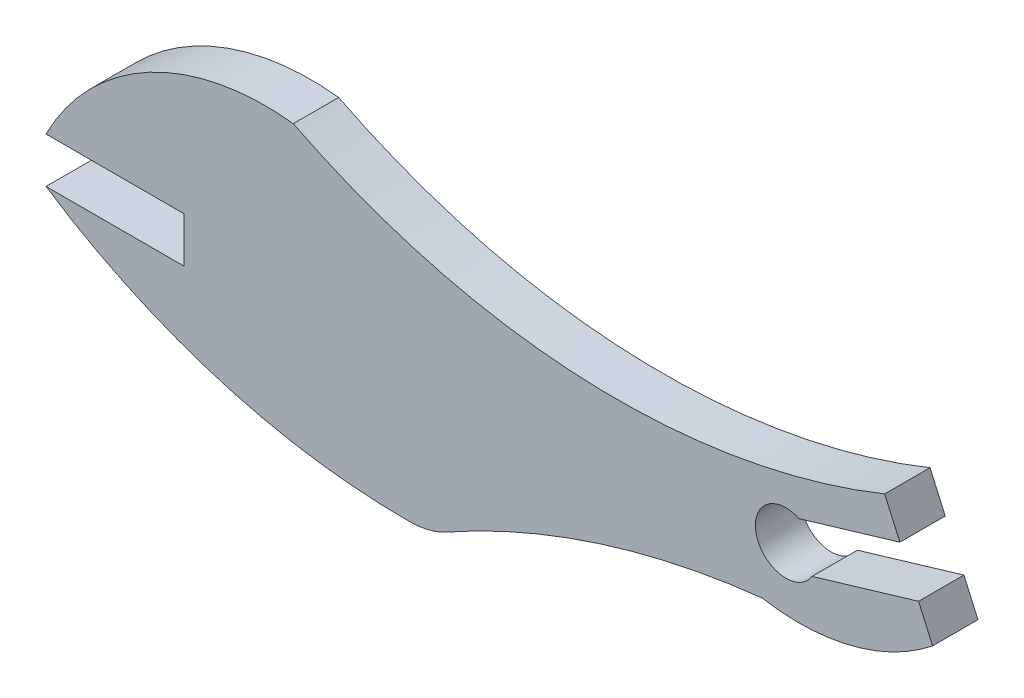
ISO-10303-21;
HEADER;
FILE_DESCRIPTION(('STEP AP214'),'2;1');
FILE_NAME('part.step','',(''),(''),'','','');
FILE_SCHEMA(('AUTOMOTIVE_DESIGN { 1 0 10303 214 1 1 1 1 }'));
ENDSEC;
DATA;
#1=APPLICATION_CONTEXT('core data for automotive mechanical design processes');
#2=APPLICATION_PROTOCOL_DEFINITION('international standard','automotive_design',2000,#1);
#3=PRODUCT_CONTEXT('',#1,'mechanical');
#4=PRODUCT('Part','Part','',(#3));
#5=PRODUCT_RELATED_PRODUCT_CATEGORY('part','',(#4));
#6=PRODUCT_DEFINITION_FORMATION('','',#4);
#7=PRODUCT_DEFINITION_CONTEXT('part definition',#1,'design');
#8=PRODUCT_DEFINITION('design','',#6,#7);
#9=PRODUCT_DEFINITION_SHAPE('','',#8);
#10=(LENGTH_UNIT() NAMED_UNIT(*) SI_UNIT(.MILLI.,.METRE.));
#11=(NAMED_UNIT(*) PLANE_ANGLE_UNIT() SI_UNIT($,.RADIAN.));
#12=(NAMED_UNIT(*) SI_UNIT($,.STERADIAN.) SOLID_ANGLE_UNIT());
#13=UNCERTAINTY_MEASURE_WITH_UNIT(LENGTH_MEASURE(1.E-05),#10,'distance_accuracy_value','');
#14=(GEOMETRIC_REPRESENTATION_CONTEXT(3) GLOBAL_UNCERTAINTY_ASSIGNED_CONTEXT((#13)) GLOBAL_UNIT_ASSIGNED_CONTEXT((#10,
#11,#12)) REPRESENTATION_CONTEXT('',''));
#15=CARTESIAN_POINT('',(0.,0.,0.));
#16=DIRECTION('',(0.,0.,1.));
#17=DIRECTION('',(1.,0.,0.));
#18=AXIS2_PLACEMENT_3D('',#15,#16,#17);
#19=CARTESIAN_POINT('',(4.36034560996098,0.,1.524));
#20=DIRECTION('',(0.,1.,0.));
#21=DIRECTION('',(-1.,0.,0.));
#22=AXIS2_PLACEMENT_3D('',#19,#20,#21);
#23=PLANE('',#22);
#24=DIRECTION('',(1.,0.,0.));
#25=VECTOR('',#24,1.);
#26=CARTESIAN_POINT('',(4.36034560996098,0.,0.));
#27=LINE('',#26,#25);
#28=CARTESIAN_POINT('',(-0.270041396106535,0.,0.));
#29=VERTEX_POINT('',#28);
#30=CARTESIAN_POINT('',(4.36034560996098,0.,0.));
#31=VERTEX_POINT('',#30);
#32=EDGE_CURVE('E165',#29,#31,#27,.T.);
#33=ORIENTED_EDGE('',*,*,#32,.T.);
#34=DIRECTION('',(0.,0.,-1.));
#35=VECTOR('',#34,1.);
#36=CARTESIAN_POINT('',(4.36034560996098,0.,1.524));
#37=LINE('',#36,#35);
#38=CARTESIAN_POINT('',(4.36034560996098,0.,1.524));
#39=VERTEX_POINT('',#38);
#40=EDGE_CURVE('E11',#39,#31,#37,.T.);
#41=ORIENTED_EDGE('',*,*,#40,.F.);
#42=DIRECTION('',(1.,0.,0.));
#43=VECTOR('',#42,1.);
#44=CARTESIAN_POINT('',(4.36034560996098,0.,1.524));
#45=LINE('',#44,#43);
#46=CARTESIAN_POINT('',(-0.270041396106535,0.,1.524));
#47=VERTEX_POINT('',#46);
#48=EDGE_CURVE('E191',#47,#39,#45,.T.);
#49=ORIENTED_EDGE('',*,*,#48,.F.);
#50=DIRECTION('',(0.,0.,-1.));
#51=VECTOR('',#50,1.);
#52=CARTESIAN_POINT('',(-0.270041396106535,0.,1.524));
#53=LINE('',#52,#51);
#54=EDGE_CURVE('E161',#47,#29,#53,.T.);
#55=ORIENTED_EDGE('',*,*,#54,.T.);
#56=EDGE_LOOP('',(#33,#41,#49,#55));
#57=FACE_BOUND('',#56,.T.);
#58=ADVANCED_FACE('F33',(#57),#23,.F.);
#59=CARTESIAN_POINT('',(4.36034560996098,0.,1.524));
#60=DIRECTION('',(1.,0.,0.));
#61=DIRECTION('',(0.,0.,-1.));
#62=AXIS2_PLACEMENT_3D('',#59,#60,#61);
#63=PLANE('',#62);
#64=DIRECTION('',(0.,-1.,0.));
#65=VECTOR('',#64,1.);
#66=CARTESIAN_POINT('',(4.36034560996098,0.,0.));
#67=LINE('',#66,#65);
#68=CARTESIAN_POINT('',(4.36034560996098,-1.52399999999999,0.));
#69=VERTEX_POINT('',#68);
#70=EDGE_CURVE('E168',#31,#69,#67,.T.);
#71=ORIENTED_EDGE('',*,*,#70,.T.);
#72=DIRECTION('',(0.,0.,-1.));
#73=VECTOR('',#72,1.);
#74=CARTESIAN_POINT('',(4.36034560996098,-1.52399999999999,1.524));
#75=LINE('',#74,#73);
#76=CARTESIAN_POINT('',(4.36034560996098,-1.52399999999999,1.524));
#77=VERTEX_POINT('',#76);
#78=EDGE_CURVE('E41',#77,#69,#75,.T.);
#79=ORIENTED_EDGE('',*,*,#78,.F.);
#80=DIRECTION('',(0.,-1.,0.));
#81=VECTOR('',#80,1.);
#82=CARTESIAN_POINT('',(4.36034560996098,0.,1.524));
#83=LINE('',#82,#81);
#84=EDGE_CURVE('E110',#39,#77,#83,.T.);
#85=ORIENTED_EDGE('',*,*,#84,.F.);
#86=ORIENTED_EDGE('',*,*,#40,.T.);
#87=EDGE_LOOP('',(#71,#79,#85,#86));
#88=FACE_BOUND('',#87,.T.);
#89=ADVANCED_FACE('F279',(#88),#63,.F.);
#90=CARTESIAN_POINT('',(4.36034560996098,-1.52399999999999,1.524));
#91=DIRECTION('',(0.,-1.,0.));
#92=DIRECTION('',(0.,0.,-1.));
#93=AXIS2_PLACEMENT_3D('',#90,#91,#92);
#94=PLANE('',#93);
#95=DIRECTION('',(-1.,0.,0.));
#96=VECTOR('',#95,1.);
#97=CARTESIAN_POINT('',(4.36034560996098,-1.52399999999999,0.));
#98=LINE('',#97,#96);
#99=CARTESIAN_POINT('',(-0.270041396106535,-1.52399999999999,0.));
#100=VERTEX_POINT('',#99);
#101=EDGE_CURVE('E170',#69,#100,#98,.T.);
#102=ORIENTED_EDGE('',*,*,#101,.T.);
#103=DIRECTION('',(0.,0.,-1.));
#104=VECTOR('',#103,1.);
#105=CARTESIAN_POINT('',(-0.270041396106535,-1.52399999999999,1.524));
#106=LINE('',#105,#104);
#107=CARTESIAN_POINT('',(-0.270041396106535,-1.52399999999999,1.524));
#108=VERTEX_POINT('',#107);
#109=EDGE_CURVE('E216',#108,#100,#106,.T.);
#110=ORIENTED_EDGE('',*,*,#109,.F.);
#111=DIRECTION('',(-1.,0.,0.));
#112=VECTOR('',#111,1.);
#113=CARTESIAN_POINT('',(4.36034560996098,-1.52399999999999,1.524));
#114=LINE('',#113,#112);
#115=EDGE_CURVE('E224',#77,#108,#114,.T.);
#116=ORIENTED_EDGE('',*,*,#115,.F.);
#117=ORIENTED_EDGE('',*,*,#78,.T.);
#118=EDGE_LOOP('',(#102,#110,#116,#117));
#119=FACE_BOUND('',#118,.T.);
#120=ADVANCED_FACE('F222',(#119),#94,.F.);
#121=CARTESIAN_POINT('',(11.8710291113216,16.893382509608,1.524));
#122=DIRECTION('',(0.,0.,-1.));
#123=DIRECTION('',(-1.,0.,0.));
#124=AXIS2_PLACEMENT_3D('',#121,#122,#123);
#125=CYLINDRICAL_SURFACE('',#124,22.0591380514189);
#126=CARTESIAN_POINT('',(11.8710291113216,16.893382509608,0.));
#127=DIRECTION('',(0.,0.,1.));
#128=DIRECTION('',(1.,0.,0.));
#129=AXIS2_PLACEMENT_3D('',#126,#127,#128);
#130=CIRCLE('',#129,22.0591380514189);
#131=CARTESIAN_POINT('',(11.9641643284181,-5.16555892924832,0.));
#132=VERTEX_POINT('',#131);
#133=EDGE_CURVE('E172',#100,#132,#130,.T.);
#134=ORIENTED_EDGE('',*,*,#133,.T.);
#135=DIRECTION('',(0.,0.,-1.));
#136=VECTOR('',#135,1.);
#137=CARTESIAN_POINT('',(11.9641643284181,-5.16555892924832,1.524));
#138=LINE('',#137,#136);
#139=CARTESIAN_POINT('',(11.9641643284181,-5.16555892924832,1.524));
#140=VERTEX_POINT('',#139);
#141=EDGE_CURVE('E213',#140,#132,#138,.T.);
#142=ORIENTED_EDGE('',*,*,#141,.F.);
#143=CARTESIAN_POINT('',(11.8710291113216,16.893382509608,1.524));
#144=DIRECTION('',(0.,0.,1.));
#145=DIRECTION('',(1.,0.,0.));
#146=AXIS2_PLACEMENT_3D('',#143,#144,#145);
#147=CIRCLE('',#146,22.0591380514189);
#148=EDGE_CURVE('E242',#108,#140,#147,.T.);
#149=ORIENTED_EDGE('',*,*,#148,.F.);
#150=ORIENTED_EDGE('',*,*,#109,.T.);
#151=EDGE_LOOP('',(#134,#142,#149,#150));
#152=FACE_BOUND('',#151,.T.);
#153=ADVANCED_FACE('F233',(#152),#125,.T.);
#154=CARTESIAN_POINT('',(11.9534402715273,-2.62558156820673,1.524));
#155=DIRECTION('',(0.,0.,-1.));
#156=DIRECTION('',(-1.,0.,0.));
#157=AXIS2_PLACEMENT_3D('',#154,#155,#156);
#158=CYLINDRICAL_SURFACE('',#157,2.54);
#159=CARTESIAN_POINT('',(11.9534402715273,-2.62558156820673,0.));
#160=DIRECTION('',(0.,0.,1.));
#161=DIRECTION('',(1.,0.,0.));
#162=AXIS2_PLACEMENT_3D('',#159,#160,#161);
#163=CIRCLE('',#162,2.54);
#164=CARTESIAN_POINT('',(13.1932521156129,-4.84244119192337,0.));
#165=VERTEX_POINT('',#164);
#166=EDGE_CURVE('E174',#132,#165,#163,.T.);
#167=ORIENTED_EDGE('',*,*,#166,.T.);
#168=DIRECTION('',(0.,0.,-1.));
#169=VECTOR('',#168,1.);
#170=CARTESIAN_POINT('',(13.1932521156129,-4.84244119192337,1.524));
#171=LINE('',#170,#169);
#172=CARTESIAN_POINT('',(13.1932521156129,-4.84244119192337,1.524));
#173=VERTEX_POINT('',#172);
#174=EDGE_CURVE('E210',#173,#165,#171,.T.);
#175=ORIENTED_EDGE('',*,*,#174,.F.);
#176=CARTESIAN_POINT('',(11.9534402715273,-2.62558156820673,1.524));
#177=DIRECTION('',(0.,0.,1.));
#178=DIRECTION('',(1.,0.,0.));
#179=AXIS2_PLACEMENT_3D('',#176,#177,#178);
#180=CIRCLE('',#179,2.54);
#181=EDGE_CURVE('E239',#140,#173,#180,.T.);
#182=ORIENTED_EDGE('',*,*,#181,.F.);
#183=ORIENTED_EDGE('',*,*,#141,.T.);
#184=EDGE_LOOP('',(#167,#175,#182,#183));
#185=FACE_BOUND('',#184,.T.);
#186=ADVANCED_FACE('F237',(#185),#158,.T.);
#187=CARTESIAN_POINT('',(26.7444823284112,-29.0728720058815,1.524));
#188=DIRECTION('',(0.,0.,-1.));
#189=DIRECTION('',(-1.,0.,0.));
#190=AXIS2_PLACEMENT_3D('',#187,#188,#189);
#191=CYLINDRICAL_SURFACE('',#190,27.7623777387721);
#192=CARTESIAN_POINT('',(26.7444823284112,-29.0728720058815,0.));
#193=DIRECTION('',(0.,0.,-1.));
#194=DIRECTION('',(-1.,0.,0.));
#195=AXIS2_PLACEMENT_3D('',#192,#193,#194);
#196=CIRCLE('',#195,27.7623777387721);
#197=CARTESIAN_POINT('',(23.7735817723145,-1.4699126066422,0.));
#198=VERTEX_POINT('',#197);
#199=EDGE_CURVE('E176',#165,#198,#196,.T.);
#200=ORIENTED_EDGE('',*,*,#199,.T.);
#201=DIRECTION('',(0.,0.,-1.));
#202=VECTOR('',#201,1.);
#203=CARTESIAN_POINT('',(23.7735817723145,-1.4699126066422,1.524));
#204=LINE('',#203,#202);
#205=CARTESIAN_POINT('',(23.7735817723145,-1.4699126066422,1.524));
#206=VERTEX_POINT('',#205);
#207=EDGE_CURVE('E207',#206,#198,#204,.T.);
#208=ORIENTED_EDGE('',*,*,#207,.F.);
#209=CARTESIAN_POINT('',(26.7444823284112,-29.0728720058815,1.524));
#210=DIRECTION('',(0.,0.,-1.));
#211=DIRECTION('',(-1.,0.,0.));
#212=AXIS2_PLACEMENT_3D('',#209,#210,#211);
#213=CIRCLE('',#212,27.7623777387721);
#214=EDGE_CURVE('E241',#173,#206,#213,.T.);
#215=ORIENTED_EDGE('',*,*,#214,.F.);
#216=ORIENTED_EDGE('',*,*,#174,.T.);
#217=EDGE_LOOP('',(#200,#208,#215,#216));
#218=FACE_BOUND('',#217,.T.);
#219=ADVANCED_FACE('F292',(#218),#191,.F.);
#220=CARTESIAN_POINT('',(25.0066130752474,5.62141172138699,1.524));
#221=DIRECTION('',(0.,0.,-1.));
#222=DIRECTION('',(-1.,0.,0.));
#223=AXIS2_PLACEMENT_3D('',#220,#221,#222);
#224=CYLINDRICAL_SURFACE('',#223,7.19772512112759);
#225=CARTESIAN_POINT('',(25.0066130752474,5.62141172138699,0.));
#226=DIRECTION('',(0.,0.,1.));
#227=DIRECTION('',(-1.,0.,0.));
#228=AXIS2_PLACEMENT_3D('',#225,#226,#227);
#229=CIRCLE('',#228,7.19772512112759);
#230=CARTESIAN_POINT('',(29.5018302199428,0.,0.));
#231=VERTEX_POINT('',#230);
#232=EDGE_CURVE('E178',#198,#231,#229,.T.);
#233=ORIENTED_EDGE('',*,*,#232,.T.);
#234=DIRECTION('',(0.,0.,-1.));
#235=VECTOR('',#234,1.);
#236=CARTESIAN_POINT('',(29.5018302199428,0.,1.524));
#237=LINE('',#236,#235);
#238=CARTESIAN_POINT('',(29.5018302199428,0.,1.524));
#239=VERTEX_POINT('',#238);
#240=EDGE_CURVE('E204',#239,#231,#237,.T.);
#241=ORIENTED_EDGE('',*,*,#240,.F.);
#242=CARTESIAN_POINT('',(25.0066130752474,5.62141172138699,1.524));
#243=DIRECTION('',(0.,0.,1.));
#244=DIRECTION('',(-1.,0.,0.));
#245=AXIS2_PLACEMENT_3D('',#242,#243,#244);
#246=CIRCLE('',#245,7.19772512112759);
#247=EDGE_CURVE('E244',#206,#239,#246,.T.);
#248=ORIENTED_EDGE('',*,*,#247,.F.);
#249=ORIENTED_EDGE('',*,*,#207,.T.);
#250=EDGE_LOOP('',(#233,#241,#248,#249));
#251=FACE_BOUND('',#250,.T.);
#252=ADVANCED_FACE('F295',(#251),#224,.T.);
#253=CARTESIAN_POINT('',(29.5018302199428,0.,1.524));
#254=DIRECTION('',(-0.913415067553766,-0.40702937776744,0.));
#255=DIRECTION('',(0.40702937776744,-0.913415067553766,0.));
#256=AXIS2_PLACEMENT_3D('',#253,#254,#255);
#257=PLANE('',#256);
#258=DIRECTION('',(-0.40702937776744,0.913415067553766,0.));
#259=VECTOR('',#258,1.);
#260=CARTESIAN_POINT('',(29.5018302199428,0.,0.));
#261=LINE('',#260,#259);
#262=CARTESIAN_POINT('',(29.0286064231583,1.06196203497373,0.));
#263=VERTEX_POINT('',#262);
#264=EDGE_CURVE('E180',#231,#263,#261,.T.);
#265=ORIENTED_EDGE('',*,*,#264,.T.);
#266=DIRECTION('',(0.,0.,-1.));
#267=VECTOR('',#266,1.);
#268=CARTESIAN_POINT('',(29.0286064231583,1.06196203497373,1.524));
#269=LINE('',#268,#267);
#270=CARTESIAN_POINT('',(29.0286064231583,1.06196203497373,1.524));
#271=VERTEX_POINT('',#270);
#272=EDGE_CURVE('E201',#271,#263,#269,.T.);
#273=ORIENTED_EDGE('',*,*,#272,.F.);
#274=DIRECTION('',(-0.40702937776744,0.913415067553766,0.));
#275=VECTOR('',#274,1.);
#276=CARTESIAN_POINT('',(29.5018302199428,0.,1.524));
#277=LINE('',#276,#275);
#278=EDGE_CURVE('E250',#239,#271,#277,.T.);
#279=ORIENTED_EDGE('',*,*,#278,.F.);
#280=ORIENTED_EDGE('',*,*,#240,.T.);
#281=EDGE_LOOP('',(#265,#273,#279,#280));
#282=FACE_BOUND('',#281,.T.);
#283=ADVANCED_FACE('F299',(#282),#257,.F.);
#284=CARTESIAN_POINT('',(29.0286064231583,1.06196203497373,1.524));
#285=DIRECTION('',(0.285298275496243,-0.958438779473613,0.));
#286=DIRECTION('',(0.958438779473613,0.285298275496244,0.));
#287=AXIS2_PLACEMENT_3D('',#284,#285,#286);
#288=PLANE('',#287);
#289=DIRECTION('',(-0.958438779473613,-0.285298275496243,0.));
#290=VECTOR('',#289,1.);
#291=CARTESIAN_POINT('',(29.0286064231583,1.06196203497373,0.));
#292=LINE('',#291,#290);
#293=CARTESIAN_POINT('',(25.4530060528673,-0.00238619608178289,0.));
#294=VERTEX_POINT('',#293);
#295=EDGE_CURVE('E182',#263,#294,#292,.T.);
#296=ORIENTED_EDGE('',*,*,#295,.T.);
#297=DIRECTION('',(0.,0.,-1.));
#298=VECTOR('',#297,1.);
#299=CARTESIAN_POINT('',(25.4530060528673,-0.00238619608178289,1.524));
#300=LINE('',#299,#298);
#301=CARTESIAN_POINT('',(25.4530060528673,-0.00238619608178289,1.524));
#302=VERTEX_POINT('',#301);
#303=EDGE_CURVE('E198',#302,#294,#300,.T.);
#304=ORIENTED_EDGE('',*,*,#303,.F.);
#305=DIRECTION('',(-0.958438779473613,-0.285298275496243,0.));
#306=VECTOR('',#305,1.);
#307=CARTESIAN_POINT('',(29.0286064231583,1.06196203497373,1.524));
#308=LINE('',#307,#306);
#309=EDGE_CURVE('E252',#271,#302,#308,.T.);
#310=ORIENTED_EDGE('',*,*,#309,.F.);
#311=ORIENTED_EDGE('',*,*,#272,.T.);
#312=EDGE_LOOP('',(#296,#304,#310,#311));
#313=FACE_BOUND('',#312,.T.);
#314=ADVANCED_FACE('F303',(#313),#288,.F.);
#315=CARTESIAN_POINT('',(24.5766985358955,0.531806480141839,1.524));
#316=DIRECTION('',(0.,0.,-1.));
#317=DIRECTION('',(-1.,0.,0.));
#318=AXIS2_PLACEMENT_3D('',#315,#316,#317);
#319=CYLINDRICAL_SURFACE('',#318,1.02629268711818);
#320=CARTESIAN_POINT('',(24.5766985358955,0.531806480141839,0.));
#321=DIRECTION('',(0.,0.,-1.));
#322=DIRECTION('',(1.,0.,0.));
#323=AXIS2_PLACEMENT_3D('',#320,#321,#322);
#324=CIRCLE('',#323,1.02629268711818);
#325=CARTESIAN_POINT('',(25.018211481011,1.45827450383598,0.));
#326=VERTEX_POINT('',#325);
#327=EDGE_CURVE('E184',#294,#326,#324,.T.);
#328=ORIENTED_EDGE('',*,*,#327,.T.);
#329=DIRECTION('',(0.,0.,-1.));
#330=VECTOR('',#329,1.);
#331=CARTESIAN_POINT('',(25.018211481011,1.45827450383598,1.524));
#332=LINE('',#331,#330);
#333=CARTESIAN_POINT('',(25.018211481011,1.45827450383598,1.524));
#334=VERTEX_POINT('',#333);
#335=EDGE_CURVE('E195',#334,#326,#332,.T.);
#336=ORIENTED_EDGE('',*,*,#335,.F.);
#337=CARTESIAN_POINT('',(24.5766985358955,0.531806480141839,1.524));
#338=DIRECTION('',(0.,0.,-1.));
#339=DIRECTION('',(1.,0.,0.));
#340=AXIS2_PLACEMENT_3D('',#337,#338,#339);
#341=CIRCLE('',#340,1.02629268711818);
#342=EDGE_CURVE('E254',#302,#334,#341,.T.);
#343=ORIENTED_EDGE('',*,*,#342,.F.);
#344=ORIENTED_EDGE('',*,*,#303,.T.);
#345=EDGE_LOOP('',(#328,#336,#343,#344));
#346=FACE_BOUND('',#345,.T.);
#347=ADVANCED_FACE('F260',(#346),#319,.F.);
#348=CARTESIAN_POINT('',(28.4030245013134,2.4658311034342,1.524));
#349=DIRECTION('',(-0.285298275496244,0.958438779473613,0.));
#350=DIRECTION('',(-0.958438779473613,-0.285298275496244,0.));
#351=AXIS2_PLACEMENT_3D('',#348,#349,#350);
#352=PLANE('',#351);
#353=DIRECTION('',(0.958438779473613,0.285298275496244,0.));
#354=VECTOR('',#353,1.);
#355=CARTESIAN_POINT('',(28.4030245013134,2.4658311034342,0.));
#356=LINE('',#355,#354);
#357=CARTESIAN_POINT('',(28.4030245013134,2.4658311034342,0.));
#358=VERTEX_POINT('',#357);
#359=EDGE_CURVE('E186',#326,#358,#356,.T.);
#360=ORIENTED_EDGE('',*,*,#359,.T.);
#361=DIRECTION('',(0.,0.,-1.));
#362=VECTOR('',#361,1.);
#363=CARTESIAN_POINT('',(28.4030245013134,2.4658311034342,1.524));
#364=LINE('',#363,#362);
#365=CARTESIAN_POINT('',(28.4030245013134,2.4658311034342,1.524));
#366=VERTEX_POINT('',#365);
#367=EDGE_CURVE('E156',#366,#358,#364,.T.);
#368=ORIENTED_EDGE('',*,*,#367,.F.);
#369=DIRECTION('',(0.958438779473613,0.285298275496244,0.));
#370=VECTOR('',#369,1.);
#371=CARTESIAN_POINT('',(28.4030245013134,2.4658311034342,1.524));
#372=LINE('',#371,#370);
#373=EDGE_CURVE('E147',#334,#366,#372,.T.);
#374=ORIENTED_EDGE('',*,*,#373,.F.);
#375=ORIENTED_EDGE('',*,*,#335,.T.);
#376=EDGE_LOOP('',(#360,#368,#374,#375));
#377=FACE_BOUND('',#376,.T.);
#378=ADVANCED_FACE('F264',(#377),#352,.F.);
#379=CARTESIAN_POINT('',(28.4030245013134,2.4658311034342,1.524));
#380=DIRECTION('',(-0.913415067553766,-0.407029377767439,0.));
#381=DIRECTION('',(0.40702937776744,-0.913415067553766,0.));
#382=AXIS2_PLACEMENT_3D('',#379,#380,#381);
#383=PLANE('',#382);
#384=DIRECTION('',(-0.407029377767439,0.913415067553766,0.));
#385=VECTOR('',#384,1.);
#386=CARTESIAN_POINT('',(28.4030245013134,2.4658311034342,0.));
#387=LINE('',#386,#385);
#388=CARTESIAN_POINT('',(27.8911331119502,3.61456712479935,0.));
#389=VERTEX_POINT('',#388);
#390=EDGE_CURVE('E155',#358,#389,#387,.T.);
#391=ORIENTED_EDGE('',*,*,#390,.T.);
#392=DIRECTION('',(0.,0.,-1.));
#393=VECTOR('',#392,1.);
#394=CARTESIAN_POINT('',(27.8911331119502,3.61456712479935,1.524));
#395=LINE('',#394,#393);
#396=CARTESIAN_POINT('',(27.8911331119502,3.61456712479935,1.524));
#397=VERTEX_POINT('',#396);
#398=EDGE_CURVE('E152',#397,#389,#395,.T.);
#399=ORIENTED_EDGE('',*,*,#398,.F.);
#400=DIRECTION('',(-0.407029377767439,0.913415067553766,0.));
#401=VECTOR('',#400,1.);
#402=CARTESIAN_POINT('',(28.4030245013134,2.4658311034342,1.524));
#403=LINE('',#402,#401);
#404=EDGE_CURVE('E141',#366,#397,#403,.T.);
#405=ORIENTED_EDGE('',*,*,#404,.F.);
#406=ORIENTED_EDGE('',*,*,#367,.T.);
#407=EDGE_LOOP('',(#391,#399,#405,#406));
#408=FACE_BOUND('',#407,.T.);
#409=ADVANCED_FACE('F153',(#408),#383,.F.);
#410=CARTESIAN_POINT('',(18.8891813041693,25.9668237784669,1.524));
#411=DIRECTION('',(0.,0.,-1.));
#412=DIRECTION('',(-1.,0.,0.));
#413=AXIS2_PLACEMENT_3D('',#410,#411,#412);
#414=CYLINDRICAL_SURFACE('',#413,24.0968569290901);
#415=CARTESIAN_POINT('',(18.8891813041693,25.9668237784669,0.));
#416=DIRECTION('',(0.,0.,-1.));
#417=DIRECTION('',(-1.,0.,0.));
#418=AXIS2_PLACEMENT_3D('',#415,#416,#417);
#419=CIRCLE('',#418,24.0968569290901);
#420=CARTESIAN_POINT('',(8.03383935917168,4.45357053498441,0.));
#421=VERTEX_POINT('',#420);
#422=EDGE_CURVE('E96',#389,#421,#419,.T.);
#423=ORIENTED_EDGE('',*,*,#422,.T.);
#424=DIRECTION('',(0.,0.,-1.));
#425=VECTOR('',#424,1.);
#426=CARTESIAN_POINT('',(8.03383935917168,4.45357053498441,1.524));
#427=LINE('',#426,#425);
#428=CARTESIAN_POINT('',(8.03383935917168,4.45357053498441,1.524));
#429=VERTEX_POINT('',#428);
#430=EDGE_CURVE('E157',#429,#421,#427,.T.);
#431=ORIENTED_EDGE('',*,*,#430,.F.);
#432=CARTESIAN_POINT('',(18.8891813041693,25.9668237784669,1.524));
#433=DIRECTION('',(0.,0.,-1.));
#434=DIRECTION('',(-1.,0.,0.));
#435=AXIS2_PLACEMENT_3D('',#432,#433,#434);
#436=CIRCLE('',#435,24.0968569290901);
#437=EDGE_CURVE('E145',#397,#429,#436,.T.);
#438=ORIENTED_EDGE('',*,*,#437,.F.);
#439=ORIENTED_EDGE('',*,*,#398,.T.);
#440=EDGE_LOOP('',(#423,#431,#438,#439));
#441=FACE_BOUND('',#440,.T.);
#442=ADVANCED_FACE('F159',(#441),#414,.F.);
#443=CARTESIAN_POINT('',(7.09282984180329,-3.76013843062416,1.524));
#444=DIRECTION('',(0.,0.,-1.));
#445=DIRECTION('',(-1.,0.,0.));
#446=AXIS2_PLACEMENT_3D('',#443,#444,#445);
#447=CYLINDRICAL_SURFACE('',#446,8.2674369597534);
#448=CARTESIAN_POINT('',(7.09282984180329,-3.76013843062416,0.));
#449=DIRECTION('',(0.,0.,1.));
#450=DIRECTION('',(-1.,0.,0.));
#451=AXIS2_PLACEMENT_3D('',#448,#449,#450);
#452=CIRCLE('',#451,8.2674369597534);
#453=EDGE_CURVE('E102',#421,#29,#452,.T.);
#454=ORIENTED_EDGE('',*,*,#453,.T.);
#455=ORIENTED_EDGE('',*,*,#54,.F.);
#456=CARTESIAN_POINT('',(7.09282984180329,-3.76013843062416,1.524));
#457=DIRECTION('',(0.,0.,1.));
#458=DIRECTION('',(-1.,0.,0.));
#459=AXIS2_PLACEMENT_3D('',#456,#457,#458);
#460=CIRCLE('',#459,8.2674369597534);
#461=EDGE_CURVE('E49',#429,#47,#460,.T.);
#462=ORIENTED_EDGE('',*,*,#461,.F.);
#463=ORIENTED_EDGE('',*,*,#430,.T.);
#464=EDGE_LOOP('',(#454,#455,#462,#463));
#465=FACE_BOUND('',#464,.T.);
#466=ADVANCED_FACE('F268',(#465),#447,.T.);
#467=CARTESIAN_POINT('',(7.09282984180329,-3.76013843062416,1.524));
#468=DIRECTION('',(0.,0.,-1.));
#469=DIRECTION('',(-1.,0.,0.));
#470=AXIS2_PLACEMENT_3D('',#467,#468,#469);
#471=PLANE('',#470);
#472=ORIENTED_EDGE('',*,*,#48,.T.);
#473=ORIENTED_EDGE('',*,*,#84,.T.);
#474=ORIENTED_EDGE('',*,*,#115,.T.);
#475=ORIENTED_EDGE('',*,*,#148,.T.);
#476=ORIENTED_EDGE('',*,*,#181,.T.);
#477=ORIENTED_EDGE('',*,*,#214,.T.);
#478=ORIENTED_EDGE('',*,*,#247,.T.);
#479=ORIENTED_EDGE('',*,*,#278,.T.);
#480=ORIENTED_EDGE('',*,*,#309,.T.);
#481=ORIENTED_EDGE('',*,*,#342,.T.);
#482=ORIENTED_EDGE('',*,*,#373,.T.);
#483=ORIENTED_EDGE('',*,*,#404,.T.);
#484=ORIENTED_EDGE('',*,*,#437,.T.);
#485=ORIENTED_EDGE('',*,*,#461,.T.);
#486=EDGE_LOOP('',(#472,#473,#474,#475,#476,#477,#478,#479,#480,#481,#482,#483,#484,#485));
#487=FACE_BOUND('',#486,.T.);
#488=ADVANCED_FACE('F143',(#487),#471,.F.);
#489=CARTESIAN_POINT('',(7.09282984180329,-3.76013843062416,0.));
#490=DIRECTION('',(0.,0.,-1.));
#491=DIRECTION('',(-1.,0.,0.));
#492=AXIS2_PLACEMENT_3D('',#489,#490,#491);
#493=PLANE('',#492);
#494=ORIENTED_EDGE('',*,*,#32,.F.);
#495=ORIENTED_EDGE('',*,*,#453,.F.);
#496=ORIENTED_EDGE('',*,*,#422,.F.);
#497=ORIENTED_EDGE('',*,*,#390,.F.);
#498=ORIENTED_EDGE('',*,*,#359,.F.);
#499=ORIENTED_EDGE('',*,*,#327,.F.);
#500=ORIENTED_EDGE('',*,*,#295,.F.);
#501=ORIENTED_EDGE('',*,*,#264,.F.);
#502=ORIENTED_EDGE('',*,*,#232,.F.);
#503=ORIENTED_EDGE('',*,*,#199,.F.);
#504=ORIENTED_EDGE('',*,*,#166,.F.);
#505=ORIENTED_EDGE('',*,*,#133,.F.);
#506=ORIENTED_EDGE('',*,*,#101,.F.);
#507=ORIENTED_EDGE('',*,*,#70,.F.);
#508=EDGE_LOOP('',(#494,#495,#496,#497,#498,#499,#500,#501,#502,#503,#504,#505,#506,#507));
#509=FACE_BOUND('',#508,.T.);
#510=ADVANCED_FACE('F228',(#509),#493,.T.);
#511=CLOSED_SHELL('',(#58,#89,#120,#153,#186,#219,#252,#283,#314,#347,#378,#409,#442,#466,#488,#510));
#512=MANIFOLD_SOLID_BREP('B2',#511);
#513=ADVANCED_BREP_SHAPE_REPRESENTATION('',(#18,#512),#14);
#514=SHAPE_DEFINITION_REPRESENTATION(#9,#513);
ENDSEC;
END-ISO-10303-21;
